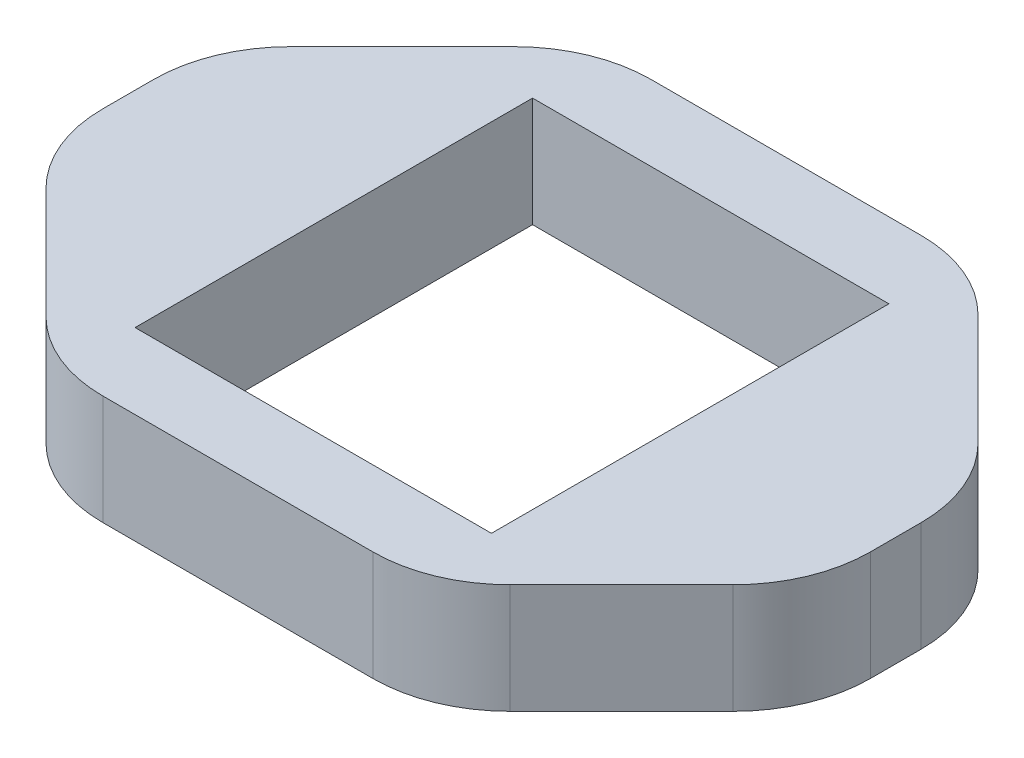
ISO-10303-21;
HEADER;
FILE_DESCRIPTION(('STEP AP214'),'2;1');
FILE_NAME('part.step','',(''),(''),'','','');
FILE_SCHEMA(('AUTOMOTIVE_DESIGN { 1 0 10303 214 1 1 1 1 }'));
ENDSEC;
DATA;
#1=APPLICATION_CONTEXT('core data for automotive mechanical design processes');
#2=APPLICATION_PROTOCOL_DEFINITION('international standard','automotive_design',2000,#1);
#3=PRODUCT_CONTEXT('',#1,'mechanical');
#4=PRODUCT('Part','Part','',(#3));
#5=PRODUCT_RELATED_PRODUCT_CATEGORY('part','',(#4));
#6=PRODUCT_DEFINITION_FORMATION('','',#4);
#7=PRODUCT_DEFINITION_CONTEXT('part definition',#1,'design');
#8=PRODUCT_DEFINITION('design','',#6,#7);
#9=PRODUCT_DEFINITION_SHAPE('','',#8);
#10=(LENGTH_UNIT() NAMED_UNIT(*) SI_UNIT(.MILLI.,.METRE.));
#11=(NAMED_UNIT(*) PLANE_ANGLE_UNIT() SI_UNIT($,.RADIAN.));
#12=(NAMED_UNIT(*) SI_UNIT($,.STERADIAN.) SOLID_ANGLE_UNIT());
#13=UNCERTAINTY_MEASURE_WITH_UNIT(LENGTH_MEASURE(1.E-05),#10,'distance_accuracy_value','');
#14=(GEOMETRIC_REPRESENTATION_CONTEXT(3) GLOBAL_UNCERTAINTY_ASSIGNED_CONTEXT((#13)) GLOBAL_UNIT_ASSIGNED_CONTEXT((#10,
#11,#12)) REPRESENTATION_CONTEXT('',''));
#15=CARTESIAN_POINT('',(0.,0.,0.));
#16=DIRECTION('',(0.,0.,1.));
#17=DIRECTION('',(1.,0.,0.));
#18=AXIS2_PLACEMENT_3D('',#15,#16,#17);
#19=CARTESIAN_POINT('',(14.,4.,10.));
#20=DIRECTION('',(-1.,0.,0.));
#21=DIRECTION('',(0.,0.,1.));
#22=AXIS2_PLACEMENT_3D('',#19,#20,#21);
#23=PLANE('',#22);
#24=DIRECTION('',(0.,0.,-1.));
#25=VECTOR('',#24,1.);
#26=CARTESIAN_POINT('',(14.,0.,10.));
#27=LINE('',#26,#25);
#28=CARTESIAN_POINT('',(14.,0.,0.928932188134526));
#29=VERTEX_POINT('',#28);
#30=CARTESIAN_POINT('',(14.,0.,-0.928932188134527));
#31=VERTEX_POINT('',#30);
#32=EDGE_CURVE('E237',#29,#31,#27,.T.);
#33=ORIENTED_EDGE('',*,*,#32,.T.);
#34=DIRECTION('',(0.,1.,0.));
#35=VECTOR('',#34,1.);
#36=CARTESIAN_POINT('',(14.,4.,-0.928932188134527));
#37=LINE('',#36,#35);
#38=CARTESIAN_POINT('',(14.,4.,-0.928932188134527));
#39=VERTEX_POINT('',#38);
#40=EDGE_CURVE('E277',#31,#39,#37,.T.);
#41=ORIENTED_EDGE('',*,*,#40,.T.);
#42=DIRECTION('',(0.,0.,-1.));
#43=VECTOR('',#42,1.);
#44=CARTESIAN_POINT('',(14.,4.,10.));
#45=LINE('',#44,#43);
#46=CARTESIAN_POINT('',(14.,4.,0.928932188134526));
#47=VERTEX_POINT('',#46);
#48=EDGE_CURVE('E243',#47,#39,#45,.T.);
#49=ORIENTED_EDGE('',*,*,#48,.F.);
#50=DIRECTION('',(0.,1.,0.));
#51=VECTOR('',#50,1.);
#52=CARTESIAN_POINT('',(14.,0.,0.928932188134526));
#53=LINE('',#52,#51);
#54=EDGE_CURVE('E260',#47,#29,#53,.F.);
#55=ORIENTED_EDGE('',*,*,#54,.T.);
#56=EDGE_LOOP('',(#33,#41,#49,#55));
#57=FACE_BOUND('',#56,.T.);
#58=ADVANCED_FACE('F44',(#57),#23,.F.);
#59=CARTESIAN_POINT('',(-14.,4.,-10.));
#60=DIRECTION('',(0.,0.,1.));
#61=DIRECTION('',(1.,0.,0.));
#62=AXIS2_PLACEMENT_3D('',#59,#60,#61);
#63=PLANE('',#62);
#64=DIRECTION('',(-1.,0.,0.));
#65=VECTOR('',#64,1.);
#66=CARTESIAN_POINT('',(-14.,4.,-10.));
#67=LINE('',#66,#65);
#68=CARTESIAN_POINT('',(4.92893218813453,4.,-10.));
#69=VERTEX_POINT('',#68);
#70=CARTESIAN_POINT('',(-4.92893218813453,4.,-10.));
#71=VERTEX_POINT('',#70);
#72=EDGE_CURVE('E247',#69,#71,#67,.T.);
#73=ORIENTED_EDGE('',*,*,#72,.F.);
#74=DIRECTION('',(0.,1.,0.));
#75=VECTOR('',#74,1.);
#76=CARTESIAN_POINT('',(4.92893218813453,0.,-10.));
#77=LINE('',#76,#75);
#78=CARTESIAN_POINT('',(4.92893218813453,0.,-10.));
#79=VERTEX_POINT('',#78);
#80=EDGE_CURVE('E339',#69,#79,#77,.F.);
#81=ORIENTED_EDGE('',*,*,#80,.T.);
#82=DIRECTION('',(-1.,0.,0.));
#83=VECTOR('',#82,1.);
#84=CARTESIAN_POINT('',(-14.,0.,-10.));
#85=LINE('',#84,#83);
#86=CARTESIAN_POINT('',(-4.92893218813453,0.,-10.));
#87=VERTEX_POINT('',#86);
#88=EDGE_CURVE('E264',#79,#87,#85,.T.);
#89=ORIENTED_EDGE('',*,*,#88,.T.);
#90=DIRECTION('',(0.,1.,0.));
#91=VECTOR('',#90,1.);
#92=CARTESIAN_POINT('',(-4.92893218813453,4.,-10.));
#93=LINE('',#92,#91);
#94=EDGE_CURVE('E335',#87,#71,#93,.T.);
#95=ORIENTED_EDGE('',*,*,#94,.T.);
#96=EDGE_LOOP('',(#73,#81,#89,#95));
#97=FACE_BOUND('',#96,.T.);
#98=ADVANCED_FACE('F437',(#97),#63,.F.);
#99=CARTESIAN_POINT('',(-14.,4.,10.));
#100=DIRECTION('',(1.,0.,0.));
#101=DIRECTION('',(0.,0.,-1.));
#102=AXIS2_PLACEMENT_3D('',#99,#100,#101);
#103=PLANE('',#102);
#104=DIRECTION('',(0.,0.,1.));
#105=VECTOR('',#104,1.);
#106=CARTESIAN_POINT('',(-14.,4.,10.));
#107=LINE('',#106,#105);
#108=CARTESIAN_POINT('',(-14.,4.,-0.928932188134526));
#109=VERTEX_POINT('',#108);
#110=CARTESIAN_POINT('',(-14.,4.,0.928932188134526));
#111=VERTEX_POINT('',#110);
#112=EDGE_CURVE('E252',#109,#111,#107,.T.);
#113=ORIENTED_EDGE('',*,*,#112,.F.);
#114=DIRECTION('',(0.,1.,0.));
#115=VECTOR('',#114,1.);
#116=CARTESIAN_POINT('',(-14.,4.,-0.928932188134526));
#117=LINE('',#116,#115);
#118=CARTESIAN_POINT('',(-14.,0.,-0.928932188134526));
#119=VERTEX_POINT('',#118);
#120=EDGE_CURVE('E353',#109,#119,#117,.F.);
#121=ORIENTED_EDGE('',*,*,#120,.T.);
#122=DIRECTION('',(0.,0.,1.));
#123=VECTOR('',#122,1.);
#124=CARTESIAN_POINT('',(-14.,0.,10.));
#125=LINE('',#124,#123);
#126=CARTESIAN_POINT('',(-14.,0.,0.928932188134526));
#127=VERTEX_POINT('',#126);
#128=EDGE_CURVE('E268',#119,#127,#125,.T.);
#129=ORIENTED_EDGE('',*,*,#128,.T.);
#130=DIRECTION('',(0.,1.,0.));
#131=VECTOR('',#130,1.);
#132=CARTESIAN_POINT('',(-14.,4.,0.928932188134526));
#133=LINE('',#132,#131);
#134=EDGE_CURVE('E349',#127,#111,#133,.T.);
#135=ORIENTED_EDGE('',*,*,#134,.T.);
#136=EDGE_LOOP('',(#113,#121,#129,#135));
#137=FACE_BOUND('',#136,.T.);
#138=ADVANCED_FACE('F391',(#137),#103,.F.);
#139=CARTESIAN_POINT('',(-14.,4.,10.));
#140=DIRECTION('',(0.,0.,-1.));
#141=DIRECTION('',(-1.,0.,0.));
#142=AXIS2_PLACEMENT_3D('',#139,#140,#141);
#143=PLANE('',#142);
#144=DIRECTION('',(1.,0.,0.));
#145=VECTOR('',#144,1.);
#146=CARTESIAN_POINT('',(-14.,0.,10.));
#147=LINE('',#146,#145);
#148=CARTESIAN_POINT('',(-4.92893218813453,0.,10.));
#149=VERTEX_POINT('',#148);
#150=CARTESIAN_POINT('',(4.92893218813453,0.,10.));
#151=VERTEX_POINT('',#150);
#152=EDGE_CURVE('E248',#149,#151,#147,.T.);
#153=ORIENTED_EDGE('',*,*,#152,.T.);
#154=DIRECTION('',(0.,1.,0.));
#155=VECTOR('',#154,1.);
#156=CARTESIAN_POINT('',(4.92893218813453,4.,10.));
#157=LINE('',#156,#155);
#158=CARTESIAN_POINT('',(4.92893218813453,4.,10.));
#159=VERTEX_POINT('',#158);
#160=EDGE_CURVE('E365',#151,#159,#157,.T.);
#161=ORIENTED_EDGE('',*,*,#160,.T.);
#162=DIRECTION('',(1.,0.,0.));
#163=VECTOR('',#162,1.);
#164=CARTESIAN_POINT('',(-14.,4.,10.));
#165=LINE('',#164,#163);
#166=CARTESIAN_POINT('',(-4.92893218813453,4.,10.));
#167=VERTEX_POINT('',#166);
#168=EDGE_CURVE('E256',#167,#159,#165,.T.);
#169=ORIENTED_EDGE('',*,*,#168,.F.);
#170=DIRECTION('',(0.,1.,0.));
#171=VECTOR('',#170,1.);
#172=CARTESIAN_POINT('',(-4.92893218813453,0.,10.));
#173=LINE('',#172,#171);
#174=EDGE_CURVE('E362',#167,#149,#173,.F.);
#175=ORIENTED_EDGE('',*,*,#174,.T.);
#176=EDGE_LOOP('',(#153,#161,#169,#175));
#177=FACE_BOUND('',#176,.T.);
#178=ADVANCED_FACE('F479',(#177),#143,.F.);
#179=CARTESIAN_POINT('',(0.,4.,0.));
#180=DIRECTION('',(0.,-1.,0.));
#181=DIRECTION('',(0.,0.,-1.));
#182=AXIS2_PLACEMENT_3D('',#179,#180,#181);
#183=PLANE('',#182);
#184=DIRECTION('',(-1.,0.,0.));
#185=VECTOR('',#184,1.);
#186=CARTESIAN_POINT('',(-6.5,4.,-7.25));
#187=LINE('',#186,#185);
#188=CARTESIAN_POINT('',(6.5,4.,-7.25));
#189=VERTEX_POINT('',#188);
#190=CARTESIAN_POINT('',(-6.5,4.,-7.25));
#191=VERTEX_POINT('',#190);
#192=EDGE_CURVE('E227',#189,#191,#187,.T.);
#193=ORIENTED_EDGE('',*,*,#192,.F.);
#194=DIRECTION('',(0.,0.,-1.));
#195=VECTOR('',#194,1.);
#196=CARTESIAN_POINT('',(6.5,4.,7.25));
#197=LINE('',#196,#195);
#198=CARTESIAN_POINT('',(6.5,4.,7.25));
#199=VERTEX_POINT('',#198);
#200=EDGE_CURVE('E191',#199,#189,#197,.T.);
#201=ORIENTED_EDGE('',*,*,#200,.F.);
#202=DIRECTION('',(1.,0.,0.));
#203=VECTOR('',#202,1.);
#204=CARTESIAN_POINT('',(-6.5,4.,7.25));
#205=LINE('',#204,#203);
#206=CARTESIAN_POINT('',(-6.5,4.,7.25));
#207=VERTEX_POINT('',#206);
#208=EDGE_CURVE('E211',#207,#199,#205,.T.);
#209=ORIENTED_EDGE('',*,*,#208,.F.);
#210=DIRECTION('',(0.,0.,1.));
#211=VECTOR('',#210,1.);
#212=CARTESIAN_POINT('',(-6.5,4.,7.25));
#213=LINE('',#212,#211);
#214=EDGE_CURVE('E215',#191,#207,#213,.T.);
#215=ORIENTED_EDGE('',*,*,#214,.F.);
#216=EDGE_LOOP('',(#193,#201,#209,#215));
#217=FACE_BOUND('',#216,.T.);
#218=ORIENTED_EDGE('',*,*,#48,.T.);
#219=CARTESIAN_POINT('',(9.,4.,-0.928932188134527));
#220=DIRECTION('',(0.,-1.,0.));
#221=DIRECTION('',(0.,0.,-1.));
#222=AXIS2_PLACEMENT_3D('',#219,#220,#221);
#223=CIRCLE('',#222,5.);
#224=CARTESIAN_POINT('',(12.5355339059327,4.,-4.46446609406726));
#225=VERTEX_POINT('',#224);
#226=EDGE_CURVE('E302',#39,#225,#223,.F.);
#227=ORIENTED_EDGE('',*,*,#226,.T.);
#228=DIRECTION('',(-0.707106781186548,0.,-0.707106781186548));
#229=VECTOR('',#228,1.);
#230=CARTESIAN_POINT('',(8.5,4.,-8.5));
#231=LINE('',#230,#229);
#232=CARTESIAN_POINT('',(8.46446609406726,4.,-8.53553390593274));
#233=VERTEX_POINT('',#232);
#234=EDGE_CURVE('E419',#225,#233,#231,.T.);
#235=ORIENTED_EDGE('',*,*,#234,.T.);
#236=CARTESIAN_POINT('',(4.92893218813453,4.,-5.));
#237=DIRECTION('',(0.,-1.,0.));
#238=DIRECTION('',(0.,0.,-1.));
#239=AXIS2_PLACEMENT_3D('',#236,#237,#238);
#240=CIRCLE('',#239,5.);
#241=EDGE_CURVE('E299',#233,#69,#240,.F.);
#242=ORIENTED_EDGE('',*,*,#241,.T.);
#243=ORIENTED_EDGE('',*,*,#72,.T.);
#244=CARTESIAN_POINT('',(-4.92893218813453,4.,-5.));
#245=DIRECTION('',(0.,-1.,0.));
#246=DIRECTION('',(0.,0.,-1.));
#247=AXIS2_PLACEMENT_3D('',#244,#245,#246);
#248=CIRCLE('',#247,5.);
#249=CARTESIAN_POINT('',(-8.46446609406726,4.,-8.53553390593274));
#250=VERTEX_POINT('',#249);
#251=EDGE_CURVE('E296',#71,#250,#248,.F.);
#252=ORIENTED_EDGE('',*,*,#251,.T.);
#253=DIRECTION('',(0.707106781186548,0.,-0.707106781186548));
#254=VECTOR('',#253,1.);
#255=CARTESIAN_POINT('',(-8.5,4.,-8.5));
#256=LINE('',#255,#254);
#257=CARTESIAN_POINT('',(-12.5355339059327,4.,-4.46446609406726));
#258=VERTEX_POINT('',#257);
#259=EDGE_CURVE('E218',#258,#250,#256,.T.);
#260=ORIENTED_EDGE('',*,*,#259,.F.);
#261=CARTESIAN_POINT('',(-9.,4.,-0.928932188134526));
#262=DIRECTION('',(0.,-1.,0.));
#263=DIRECTION('',(0.,0.,-1.));
#264=AXIS2_PLACEMENT_3D('',#261,#262,#263);
#265=CIRCLE('',#264,5.);
#266=EDGE_CURVE('E293',#258,#109,#265,.F.);
#267=ORIENTED_EDGE('',*,*,#266,.T.);
#268=ORIENTED_EDGE('',*,*,#112,.T.);
#269=CARTESIAN_POINT('',(-9.,4.,0.928932188134526));
#270=DIRECTION('',(0.,-1.,0.));
#271=DIRECTION('',(0.,0.,-1.));
#272=AXIS2_PLACEMENT_3D('',#269,#270,#271);
#273=CIRCLE('',#272,5.);
#274=CARTESIAN_POINT('',(-12.5355339059327,4.,4.46446609406726));
#275=VERTEX_POINT('',#274);
#276=EDGE_CURVE('E281',#111,#275,#273,.F.);
#277=ORIENTED_EDGE('',*,*,#276,.T.);
#278=DIRECTION('',(0.707106781186548,0.,0.707106781186548));
#279=VECTOR('',#278,1.);
#280=CARTESIAN_POINT('',(-8.5,4.,8.5));
#281=LINE('',#280,#279);
#282=CARTESIAN_POINT('',(-8.46446609406726,4.,8.53553390593274));
#283=VERTEX_POINT('',#282);
#284=EDGE_CURVE('E378',#275,#283,#281,.T.);
#285=ORIENTED_EDGE('',*,*,#284,.T.);
#286=CARTESIAN_POINT('',(-4.92893218813453,4.,5.));
#287=DIRECTION('',(0.,-1.,0.));
#288=DIRECTION('',(0.,0.,-1.));
#289=AXIS2_PLACEMENT_3D('',#286,#287,#288);
#290=CIRCLE('',#289,5.);
#291=EDGE_CURVE('E284',#283,#167,#290,.F.);
#292=ORIENTED_EDGE('',*,*,#291,.T.);
#293=ORIENTED_EDGE('',*,*,#168,.T.);
#294=CARTESIAN_POINT('',(4.92893218813453,4.,5.));
#295=DIRECTION('',(0.,-1.,0.));
#296=DIRECTION('',(0.,0.,-1.));
#297=AXIS2_PLACEMENT_3D('',#294,#295,#296);
#298=CIRCLE('',#297,5.);
#299=CARTESIAN_POINT('',(8.46446609406726,4.,8.53553390593274));
#300=VERTEX_POINT('',#299);
#301=EDGE_CURVE('E287',#159,#300,#298,.F.);
#302=ORIENTED_EDGE('',*,*,#301,.T.);
#303=DIRECTION('',(0.707106781186548,0.,-0.707106781186548));
#304=VECTOR('',#303,1.);
#305=CARTESIAN_POINT('',(8.5,4.,8.5));
#306=LINE('',#305,#304);
#307=CARTESIAN_POINT('',(12.5355339059327,4.,4.46446609406726));
#308=VERTEX_POINT('',#307);
#309=EDGE_CURVE('E386',#300,#308,#306,.T.);
#310=ORIENTED_EDGE('',*,*,#309,.T.);
#311=CARTESIAN_POINT('',(9.,4.,0.928932188134526));
#312=DIRECTION('',(0.,-1.,0.));
#313=DIRECTION('',(0.,0.,-1.));
#314=AXIS2_PLACEMENT_3D('',#311,#312,#313);
#315=CIRCLE('',#314,5.);
#316=EDGE_CURVE('E290',#308,#47,#315,.F.);
#317=ORIENTED_EDGE('',*,*,#316,.T.);
#318=EDGE_LOOP('',(#218,#227,#235,#242,#243,#252,#260,#267,#268,#277,#285,#292,#293,#302,#310,#317));
#319=FACE_BOUND('',#318,.T.);
#320=ADVANCED_FACE('F394',(#217,#319),#183,.F.);
#321=CARTESIAN_POINT('',(0.,0.,0.));
#322=DIRECTION('',(0.,-1.,0.));
#323=DIRECTION('',(0.,0.,-1.));
#324=AXIS2_PLACEMENT_3D('',#321,#322,#323);
#325=PLANE('',#324);
#326=DIRECTION('',(0.,0.,-1.));
#327=VECTOR('',#326,1.);
#328=CARTESIAN_POINT('',(6.5,0.,7.25));
#329=LINE('',#328,#327);
#330=CARTESIAN_POINT('',(6.5,0.,7.25));
#331=VERTEX_POINT('',#330);
#332=CARTESIAN_POINT('',(6.5,0.,-7.25));
#333=VERTEX_POINT('',#332);
#334=EDGE_CURVE('E188',#331,#333,#329,.T.);
#335=ORIENTED_EDGE('',*,*,#334,.T.);
#336=DIRECTION('',(-1.,0.,0.));
#337=VECTOR('',#336,1.);
#338=CARTESIAN_POINT('',(-6.5,0.,-7.25));
#339=LINE('',#338,#337);
#340=CARTESIAN_POINT('',(-6.5,0.,-7.25));
#341=VERTEX_POINT('',#340);
#342=EDGE_CURVE('E201',#333,#341,#339,.T.);
#343=ORIENTED_EDGE('',*,*,#342,.T.);
#344=DIRECTION('',(0.,0.,1.));
#345=VECTOR('',#344,1.);
#346=CARTESIAN_POINT('',(-6.5,0.,7.25));
#347=LINE('',#346,#345);
#348=CARTESIAN_POINT('',(-6.5,0.,7.25));
#349=VERTEX_POINT('',#348);
#350=EDGE_CURVE('E206',#341,#349,#347,.T.);
#351=ORIENTED_EDGE('',*,*,#350,.T.);
#352=DIRECTION('',(1.,0.,0.));
#353=VECTOR('',#352,1.);
#354=CARTESIAN_POINT('',(-6.5,0.,7.25));
#355=LINE('',#354,#353);
#356=EDGE_CURVE('E197',#349,#331,#355,.T.);
#357=ORIENTED_EDGE('',*,*,#356,.T.);
#358=EDGE_LOOP('',(#335,#343,#351,#357));
#359=FACE_BOUND('',#358,.T.);
#360=DIRECTION('',(-0.707106781186548,0.,-0.707106781186548));
#361=VECTOR('',#360,1.);
#362=CARTESIAN_POINT('',(8.5,0.,-8.5));
#363=LINE('',#362,#361);
#364=CARTESIAN_POINT('',(12.5355339059327,0.,-4.46446609406726));
#365=VERTEX_POINT('',#364);
#366=CARTESIAN_POINT('',(8.46446609406726,0.,-8.53553390593274));
#367=VERTEX_POINT('',#366);
#368=EDGE_CURVE('E409',#365,#367,#363,.T.);
#369=ORIENTED_EDGE('',*,*,#368,.F.);
#370=CARTESIAN_POINT('',(9.,0.,-0.928932188134527));
#371=DIRECTION('',(0.,-1.,0.));
#372=DIRECTION('',(0.,0.,-1.));
#373=AXIS2_PLACEMENT_3D('',#370,#371,#372);
#374=CIRCLE('',#373,5.);
#375=EDGE_CURVE('E332',#365,#31,#374,.T.);
#376=ORIENTED_EDGE('',*,*,#375,.T.);
#377=ORIENTED_EDGE('',*,*,#32,.F.);
#378=CARTESIAN_POINT('',(9.,0.,0.928932188134526));
#379=DIRECTION('',(0.,-1.,0.));
#380=DIRECTION('',(0.,0.,-1.));
#381=AXIS2_PLACEMENT_3D('',#378,#379,#380);
#382=CIRCLE('',#381,5.);
#383=CARTESIAN_POINT('',(12.5355339059327,0.,4.46446609406726));
#384=VERTEX_POINT('',#383);
#385=EDGE_CURVE('E60',#29,#384,#382,.T.);
#386=ORIENTED_EDGE('',*,*,#385,.T.);
#387=DIRECTION('',(0.707106781186548,0.,-0.707106781186548));
#388=VECTOR('',#387,1.);
#389=CARTESIAN_POINT('',(8.5,0.,8.5));
#390=LINE('',#389,#388);
#391=CARTESIAN_POINT('',(8.46446609406726,0.,8.53553390593274));
#392=VERTEX_POINT('',#391);
#393=EDGE_CURVE('E416',#392,#384,#390,.T.);
#394=ORIENTED_EDGE('',*,*,#393,.F.);
#395=CARTESIAN_POINT('',(4.92893218813453,0.,5.));
#396=DIRECTION('',(0.,-1.,0.));
#397=DIRECTION('',(0.,0.,-1.));
#398=AXIS2_PLACEMENT_3D('',#395,#396,#397);
#399=CIRCLE('',#398,5.);
#400=EDGE_CURVE('E318',#392,#151,#399,.T.);
#401=ORIENTED_EDGE('',*,*,#400,.T.);
#402=ORIENTED_EDGE('',*,*,#152,.F.);
#403=CARTESIAN_POINT('',(-4.92893218813453,0.,5.));
#404=DIRECTION('',(0.,-1.,0.));
#405=DIRECTION('',(0.,0.,-1.));
#406=AXIS2_PLACEMENT_3D('',#403,#404,#405);
#407=CIRCLE('',#406,5.);
#408=CARTESIAN_POINT('',(-8.46446609406726,0.,8.53553390593274));
#409=VERTEX_POINT('',#408);
#410=EDGE_CURVE('E315',#149,#409,#407,.T.);
#411=ORIENTED_EDGE('',*,*,#410,.T.);
#412=DIRECTION('',(0.707106781186548,0.,0.707106781186548));
#413=VECTOR('',#412,1.);
#414=CARTESIAN_POINT('',(-8.5,0.,8.5));
#415=LINE('',#414,#413);
#416=CARTESIAN_POINT('',(-12.5355339059327,0.,4.46446609406726));
#417=VERTEX_POINT('',#416);
#418=EDGE_CURVE('E375',#417,#409,#415,.T.);
#419=ORIENTED_EDGE('',*,*,#418,.F.);
#420=CARTESIAN_POINT('',(-9.,0.,0.928932188134526));
#421=DIRECTION('',(0.,-1.,0.));
#422=DIRECTION('',(0.,0.,-1.));
#423=AXIS2_PLACEMENT_3D('',#420,#421,#422);
#424=CIRCLE('',#423,5.);
#425=EDGE_CURVE('E312',#417,#127,#424,.T.);
#426=ORIENTED_EDGE('',*,*,#425,.T.);
#427=ORIENTED_EDGE('',*,*,#128,.F.);
#428=CARTESIAN_POINT('',(-9.,0.,-0.928932188134526));
#429=DIRECTION('',(0.,-1.,0.));
#430=DIRECTION('',(0.,0.,-1.));
#431=AXIS2_PLACEMENT_3D('',#428,#429,#430);
#432=CIRCLE('',#431,5.);
#433=CARTESIAN_POINT('',(-12.5355339059327,0.,-4.46446609406726));
#434=VERTEX_POINT('',#433);
#435=EDGE_CURVE('E323',#119,#434,#432,.T.);
#436=ORIENTED_EDGE('',*,*,#435,.T.);
#437=DIRECTION('',(0.707106781186548,0.,-0.707106781186548));
#438=VECTOR('',#437,1.);
#439=CARTESIAN_POINT('',(-8.5,0.,-8.5));
#440=LINE('',#439,#438);
#441=CARTESIAN_POINT('',(-8.46446609406726,0.,-8.53553390593274));
#442=VERTEX_POINT('',#441);
#443=EDGE_CURVE('E228',#434,#442,#440,.T.);
#444=ORIENTED_EDGE('',*,*,#443,.T.);
#445=CARTESIAN_POINT('',(-4.92893218813453,0.,-5.));
#446=DIRECTION('',(0.,-1.,0.));
#447=DIRECTION('',(0.,0.,-1.));
#448=AXIS2_PLACEMENT_3D('',#445,#446,#447);
#449=CIRCLE('',#448,5.);
#450=EDGE_CURVE('E326',#442,#87,#449,.T.);
#451=ORIENTED_EDGE('',*,*,#450,.T.);
#452=ORIENTED_EDGE('',*,*,#88,.F.);
#453=CARTESIAN_POINT('',(4.92893218813453,0.,-5.));
#454=DIRECTION('',(0.,-1.,0.));
#455=DIRECTION('',(0.,0.,-1.));
#456=AXIS2_PLACEMENT_3D('',#453,#454,#455);
#457=CIRCLE('',#456,5.);
#458=EDGE_CURVE('E329',#79,#367,#457,.T.);
#459=ORIENTED_EDGE('',*,*,#458,.T.);
#460=EDGE_LOOP('',(#369,#376,#377,#386,#394,#401,#402,#411,#419,#426,#427,#436,#444,#451,#452,#459));
#461=FACE_BOUND('',#460,.T.);
#462=ADVANCED_FACE('F208',(#359,#461),#325,.T.);
#463=CARTESIAN_POINT('',(6.5,0.,7.25));
#464=DIRECTION('',(1.,0.,0.));
#465=DIRECTION('',(0.,0.,-1.));
#466=AXIS2_PLACEMENT_3D('',#463,#464,#465);
#467=PLANE('',#466);
#468=ORIENTED_EDGE('',*,*,#200,.T.);
#469=DIRECTION('',(0.,1.,0.));
#470=VECTOR('',#469,1.);
#471=CARTESIAN_POINT('',(6.5,0.,-7.25));
#472=LINE('',#471,#470);
#473=EDGE_CURVE('E184',#333,#189,#472,.T.);
#474=ORIENTED_EDGE('',*,*,#473,.F.);
#475=ORIENTED_EDGE('',*,*,#334,.F.);
#476=DIRECTION('',(0.,1.,0.));
#477=VECTOR('',#476,1.);
#478=CARTESIAN_POINT('',(6.5,0.,7.25));
#479=LINE('',#478,#477);
#480=EDGE_CURVE('E234',#331,#199,#479,.T.);
#481=ORIENTED_EDGE('',*,*,#480,.T.);
#482=EDGE_LOOP('',(#468,#474,#475,#481));
#483=FACE_BOUND('',#482,.T.);
#484=ADVANCED_FACE('F186',(#483),#467,.F.);
#485=CARTESIAN_POINT('',(-6.5,0.,7.25));
#486=DIRECTION('',(0.,0.,1.));
#487=DIRECTION('',(1.,0.,0.));
#488=AXIS2_PLACEMENT_3D('',#485,#486,#487);
#489=PLANE('',#488);
#490=ORIENTED_EDGE('',*,*,#208,.T.);
#491=ORIENTED_EDGE('',*,*,#480,.F.);
#492=ORIENTED_EDGE('',*,*,#356,.F.);
#493=DIRECTION('',(0.,1.,0.));
#494=VECTOR('',#493,1.);
#495=CARTESIAN_POINT('',(-6.5,0.,7.25));
#496=LINE('',#495,#494);
#497=EDGE_CURVE('E238',#349,#207,#496,.T.);
#498=ORIENTED_EDGE('',*,*,#497,.T.);
#499=EDGE_LOOP('',(#490,#491,#492,#498));
#500=FACE_BOUND('',#499,.T.);
#501=ADVANCED_FACE('F635',(#500),#489,.F.);
#502=CARTESIAN_POINT('',(-6.5,0.,7.25));
#503=DIRECTION('',(-1.,0.,0.));
#504=DIRECTION('',(0.,0.,1.));
#505=AXIS2_PLACEMENT_3D('',#502,#503,#504);
#506=PLANE('',#505);
#507=ORIENTED_EDGE('',*,*,#214,.T.);
#508=ORIENTED_EDGE('',*,*,#497,.F.);
#509=ORIENTED_EDGE('',*,*,#350,.F.);
#510=DIRECTION('',(0.,1.,0.));
#511=VECTOR('',#510,1.);
#512=CARTESIAN_POINT('',(-6.5,0.,-7.25));
#513=LINE('',#512,#511);
#514=EDGE_CURVE('E196',#341,#191,#513,.T.);
#515=ORIENTED_EDGE('',*,*,#514,.T.);
#516=EDGE_LOOP('',(#507,#508,#509,#515));
#517=FACE_BOUND('',#516,.T.);
#518=ADVANCED_FACE('F626',(#517),#506,.F.);
#519=CARTESIAN_POINT('',(-6.5,0.,-7.25));
#520=DIRECTION('',(0.,0.,-1.));
#521=DIRECTION('',(-1.,0.,0.));
#522=AXIS2_PLACEMENT_3D('',#519,#520,#521);
#523=PLANE('',#522);
#524=ORIENTED_EDGE('',*,*,#192,.T.);
#525=ORIENTED_EDGE('',*,*,#514,.F.);
#526=ORIENTED_EDGE('',*,*,#342,.F.);
#527=ORIENTED_EDGE('',*,*,#473,.T.);
#528=EDGE_LOOP('',(#524,#525,#526,#527));
#529=FACE_BOUND('',#528,.T.);
#530=ADVANCED_FACE('F202',(#529),#523,.F.);
#531=CARTESIAN_POINT('',(-8.5,0.,-8.5));
#532=DIRECTION('',(0.707106781186547,0.,0.707106781186547));
#533=DIRECTION('',(0.707106781186548,0.,-0.707106781186548));
#534=AXIS2_PLACEMENT_3D('',#531,#532,#533);
#535=PLANE('',#534);
#536=ORIENTED_EDGE('',*,*,#259,.T.);
#537=DIRECTION('',(0.,1.,0.));
#538=VECTOR('',#537,1.);
#539=CARTESIAN_POINT('',(-8.46446609406726,0.,-8.53553390593274));
#540=LINE('',#539,#538);
#541=EDGE_CURVE('E346',#250,#442,#540,.F.);
#542=ORIENTED_EDGE('',*,*,#541,.T.);
#543=ORIENTED_EDGE('',*,*,#443,.F.);
#544=DIRECTION('',(0.,1.,0.));
#545=VECTOR('',#544,1.);
#546=CARTESIAN_POINT('',(-12.5355339059327,0.,-4.46446609406726));
#547=LINE('',#546,#545);
#548=EDGE_CURVE('E342',#434,#258,#547,.T.);
#549=ORIENTED_EDGE('',*,*,#548,.T.);
#550=EDGE_LOOP('',(#536,#542,#543,#549));
#551=FACE_BOUND('',#550,.T.);
#552=ADVANCED_FACE('F403',(#551),#535,.F.);
#553=CARTESIAN_POINT('',(8.5,0.,-8.5));
#554=DIRECTION('',(0.707106781186547,0.,-0.707106781186547));
#555=DIRECTION('',(-0.707106781186548,0.,-0.707106781186548));
#556=AXIS2_PLACEMENT_3D('',#553,#554,#555);
#557=PLANE('',#556);
#558=ORIENTED_EDGE('',*,*,#234,.F.);
#559=DIRECTION('',(0.,1.,0.));
#560=VECTOR('',#559,1.);
#561=CARTESIAN_POINT('',(12.5355339059327,0.,-4.46446609406726));
#562=LINE('',#561,#560);
#563=EDGE_CURVE('E309',#225,#365,#562,.F.);
#564=ORIENTED_EDGE('',*,*,#563,.T.);
#565=ORIENTED_EDGE('',*,*,#368,.T.);
#566=DIRECTION('',(0.,1.,0.));
#567=VECTOR('',#566,1.);
#568=CARTESIAN_POINT('',(8.46446609406726,4.,-8.53553390593274));
#569=LINE('',#568,#567);
#570=EDGE_CURVE('E305',#367,#233,#569,.T.);
#571=ORIENTED_EDGE('',*,*,#570,.T.);
#572=EDGE_LOOP('',(#558,#564,#565,#571));
#573=FACE_BOUND('',#572,.T.);
#574=ADVANCED_FACE('F428',(#573),#557,.T.);
#575=CARTESIAN_POINT('',(8.5,0.,8.5));
#576=DIRECTION('',(0.707106781186547,0.,0.707106781186547));
#577=DIRECTION('',(0.707106781186548,0.,-0.707106781186548));
#578=AXIS2_PLACEMENT_3D('',#575,#576,#577);
#579=PLANE('',#578);
#580=ORIENTED_EDGE('',*,*,#393,.T.);
#581=DIRECTION('',(0.,1.,0.));
#582=VECTOR('',#581,1.);
#583=CARTESIAN_POINT('',(12.5355339059327,4.,4.46446609406726));
#584=LINE('',#583,#582);
#585=EDGE_CURVE('E358',#384,#308,#584,.T.);
#586=ORIENTED_EDGE('',*,*,#585,.T.);
#587=ORIENTED_EDGE('',*,*,#309,.F.);
#588=DIRECTION('',(0.,1.,0.));
#589=VECTOR('',#588,1.);
#590=CARTESIAN_POINT('',(8.46446609406726,0.,8.53553390593274));
#591=LINE('',#590,#589);
#592=EDGE_CURVE('E67',#300,#392,#591,.F.);
#593=ORIENTED_EDGE('',*,*,#592,.T.);
#594=EDGE_LOOP('',(#580,#586,#587,#593));
#595=FACE_BOUND('',#594,.T.);
#596=ADVANCED_FACE('F466',(#595),#579,.T.);
#597=CARTESIAN_POINT('',(-8.5,0.,8.5));
#598=DIRECTION('',(-0.707106781186547,0.,0.707106781186547));
#599=DIRECTION('',(0.707106781186548,0.,0.707106781186548));
#600=AXIS2_PLACEMENT_3D('',#597,#598,#599);
#601=PLANE('',#600);
#602=ORIENTED_EDGE('',*,*,#418,.T.);
#603=DIRECTION('',(0.,1.,0.));
#604=VECTOR('',#603,1.);
#605=CARTESIAN_POINT('',(-8.46446609406726,4.,8.53553390593274));
#606=LINE('',#605,#604);
#607=EDGE_CURVE('E11',#409,#283,#606,.T.);
#608=ORIENTED_EDGE('',*,*,#607,.T.);
#609=ORIENTED_EDGE('',*,*,#284,.F.);
#610=DIRECTION('',(0.,1.,0.));
#611=VECTOR('',#610,1.);
#612=CARTESIAN_POINT('',(-12.5355339059327,0.,4.46446609406726));
#613=LINE('',#612,#611);
#614=EDGE_CURVE('E53',#275,#417,#613,.F.);
#615=ORIENTED_EDGE('',*,*,#614,.T.);
#616=EDGE_LOOP('',(#602,#608,#609,#615));
#617=FACE_BOUND('',#616,.T.);
#618=ADVANCED_FACE('F374',(#617),#601,.T.);
#619=CARTESIAN_POINT('',(9.,4.,-0.928932188134527));
#620=DIRECTION('',(0.,-1.,0.));
#621=DIRECTION('',(0.,0.,-1.));
#622=AXIS2_PLACEMENT_3D('',#619,#620,#621);
#623=CYLINDRICAL_SURFACE('',#622,5.);
#624=ORIENTED_EDGE('',*,*,#375,.F.);
#625=ORIENTED_EDGE('',*,*,#563,.F.);
#626=ORIENTED_EDGE('',*,*,#226,.F.);
#627=ORIENTED_EDGE('',*,*,#40,.F.);
#628=EDGE_LOOP('',(#624,#625,#626,#627));
#629=FACE_BOUND('',#628,.T.);
#630=ADVANCED_FACE('F450',(#629),#623,.T.);
#631=CARTESIAN_POINT('',(4.92893218813453,0.,-5.));
#632=DIRECTION('',(0.,-1.,0.));
#633=DIRECTION('',(0.,0.,-1.));
#634=AXIS2_PLACEMENT_3D('',#631,#632,#633);
#635=CYLINDRICAL_SURFACE('',#634,5.);
#636=ORIENTED_EDGE('',*,*,#458,.F.);
#637=ORIENTED_EDGE('',*,*,#80,.F.);
#638=ORIENTED_EDGE('',*,*,#241,.F.);
#639=ORIENTED_EDGE('',*,*,#570,.F.);
#640=EDGE_LOOP('',(#636,#637,#638,#639));
#641=FACE_BOUND('',#640,.T.);
#642=ADVANCED_FACE('F433',(#641),#635,.T.);
#643=CARTESIAN_POINT('',(-4.92893218813453,4.,-5.));
#644=DIRECTION('',(0.,1.,0.));
#645=DIRECTION('',(0.,0.,1.));
#646=AXIS2_PLACEMENT_3D('',#643,#644,#645);
#647=CYLINDRICAL_SURFACE('',#646,5.);
#648=ORIENTED_EDGE('',*,*,#450,.F.);
#649=ORIENTED_EDGE('',*,*,#541,.F.);
#650=ORIENTED_EDGE('',*,*,#251,.F.);
#651=ORIENTED_EDGE('',*,*,#94,.F.);
#652=EDGE_LOOP('',(#648,#649,#650,#651));
#653=FACE_BOUND('',#652,.T.);
#654=ADVANCED_FACE('F441',(#653),#647,.T.);
#655=CARTESIAN_POINT('',(-9.,0.,-0.928932188134526));
#656=DIRECTION('',(0.,1.,0.));
#657=DIRECTION('',(0.,0.,1.));
#658=AXIS2_PLACEMENT_3D('',#655,#656,#657);
#659=CYLINDRICAL_SURFACE('',#658,5.);
#660=ORIENTED_EDGE('',*,*,#435,.F.);
#661=ORIENTED_EDGE('',*,*,#120,.F.);
#662=ORIENTED_EDGE('',*,*,#266,.F.);
#663=ORIENTED_EDGE('',*,*,#548,.F.);
#664=EDGE_LOOP('',(#660,#661,#662,#663));
#665=FACE_BOUND('',#664,.T.);
#666=ADVANCED_FACE('F400',(#665),#659,.T.);
#667=CARTESIAN_POINT('',(9.,0.,0.928932188134526));
#668=DIRECTION('',(0.,-1.,0.));
#669=DIRECTION('',(0.,0.,-1.));
#670=AXIS2_PLACEMENT_3D('',#667,#668,#669);
#671=CYLINDRICAL_SURFACE('',#670,5.);
#672=ORIENTED_EDGE('',*,*,#385,.F.);
#673=ORIENTED_EDGE('',*,*,#54,.F.);
#674=ORIENTED_EDGE('',*,*,#316,.F.);
#675=ORIENTED_EDGE('',*,*,#585,.F.);
#676=EDGE_LOOP('',(#672,#673,#674,#675));
#677=FACE_BOUND('',#676,.T.);
#678=ADVANCED_FACE('F448',(#677),#671,.T.);
#679=CARTESIAN_POINT('',(4.92893218813453,4.,5.));
#680=DIRECTION('',(0.,-1.,0.));
#681=DIRECTION('',(0.,0.,-1.));
#682=AXIS2_PLACEMENT_3D('',#679,#680,#681);
#683=CYLINDRICAL_SURFACE('',#682,5.);
#684=ORIENTED_EDGE('',*,*,#400,.F.);
#685=ORIENTED_EDGE('',*,*,#592,.F.);
#686=ORIENTED_EDGE('',*,*,#301,.F.);
#687=ORIENTED_EDGE('',*,*,#160,.F.);
#688=EDGE_LOOP('',(#684,#685,#686,#687));
#689=FACE_BOUND('',#688,.T.);
#690=ADVANCED_FACE('F477',(#689),#683,.T.);
#691=CARTESIAN_POINT('',(-4.92893218813453,0.,5.));
#692=DIRECTION('',(0.,-1.,0.));
#693=DIRECTION('',(0.,0.,-1.));
#694=AXIS2_PLACEMENT_3D('',#691,#692,#693);
#695=CYLINDRICAL_SURFACE('',#694,5.);
#696=ORIENTED_EDGE('',*,*,#410,.F.);
#697=ORIENTED_EDGE('',*,*,#174,.F.);
#698=ORIENTED_EDGE('',*,*,#291,.F.);
#699=ORIENTED_EDGE('',*,*,#607,.F.);
#700=EDGE_LOOP('',(#696,#697,#698,#699));
#701=FACE_BOUND('',#700,.T.);
#702=ADVANCED_FACE('F482',(#701),#695,.T.);
#703=CARTESIAN_POINT('',(-9.,4.,0.928932188134526));
#704=DIRECTION('',(0.,-1.,0.));
#705=DIRECTION('',(0.,0.,-1.));
#706=AXIS2_PLACEMENT_3D('',#703,#704,#705);
#707=CYLINDRICAL_SURFACE('',#706,5.);
#708=ORIENTED_EDGE('',*,*,#425,.F.);
#709=ORIENTED_EDGE('',*,*,#614,.F.);
#710=ORIENTED_EDGE('',*,*,#276,.F.);
#711=ORIENTED_EDGE('',*,*,#134,.F.);
#712=EDGE_LOOP('',(#708,#709,#710,#711));
#713=FACE_BOUND('',#712,.T.);
#714=ADVANCED_FACE('F46',(#713),#707,.T.);
#715=CLOSED_SHELL('',(#58,#98,#138,#178,#320,#462,#484,#501,#518,#530,#552,#574,#596,#618,#630,
#642,#654,#666,#678,#690,#702,#714));
#716=MANIFOLD_SOLID_BREP('B2',#715);
#717=ADVANCED_BREP_SHAPE_REPRESENTATION('',(#18,#716),#14);
#718=SHAPE_DEFINITION_REPRESENTATION(#9,#717);
ENDSEC;
END-ISO-10303-21;
